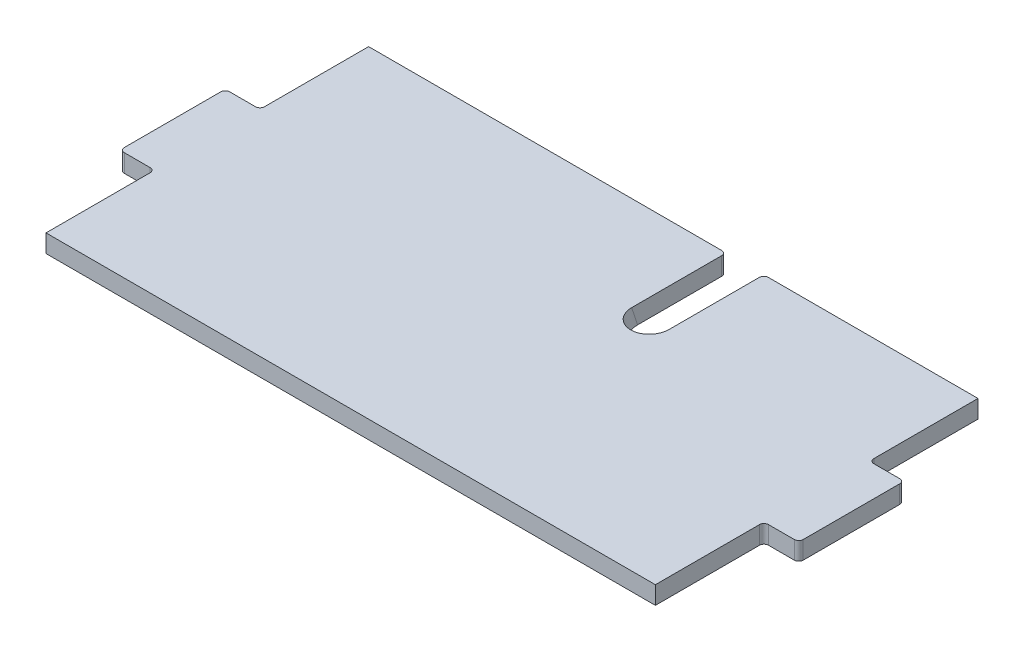
ISO-10303-21;
HEADER;
FILE_DESCRIPTION(('STEP AP214'),'2;1');
FILE_NAME('part.step','',(''),(''),'','','');
FILE_SCHEMA(('AUTOMOTIVE_DESIGN { 1 0 10303 214 1 1 1 1 }'));
ENDSEC;
DATA;
#1=APPLICATION_CONTEXT('core data for automotive mechanical design processes');
#2=APPLICATION_PROTOCOL_DEFINITION('international standard','automotive_design',2000,#1);
#3=PRODUCT_CONTEXT('',#1,'mechanical');
#4=PRODUCT('Part','Part','',(#3));
#5=PRODUCT_RELATED_PRODUCT_CATEGORY('part','',(#4));
#6=PRODUCT_DEFINITION_FORMATION('','',#4);
#7=PRODUCT_DEFINITION_CONTEXT('part definition',#1,'design');
#8=PRODUCT_DEFINITION('design','',#6,#7);
#9=PRODUCT_DEFINITION_SHAPE('','',#8);
#10=(LENGTH_UNIT() NAMED_UNIT(*) SI_UNIT(.MILLI.,.METRE.));
#11=(NAMED_UNIT(*) PLANE_ANGLE_UNIT() SI_UNIT($,.RADIAN.));
#12=(NAMED_UNIT(*) SI_UNIT($,.STERADIAN.) SOLID_ANGLE_UNIT());
#13=UNCERTAINTY_MEASURE_WITH_UNIT(LENGTH_MEASURE(1.E-05),#10,'distance_accuracy_value','');
#14=(GEOMETRIC_REPRESENTATION_CONTEXT(3) GLOBAL_UNCERTAINTY_ASSIGNED_CONTEXT((#13)) GLOBAL_UNIT_ASSIGNED_CONTEXT((#10,
#11,#12)) REPRESENTATION_CONTEXT('',''));
#15=CARTESIAN_POINT('',(0.,0.,0.));
#16=DIRECTION('',(0.,0.,1.));
#17=DIRECTION('',(1.,0.,0.));
#18=AXIS2_PLACEMENT_3D('',#15,#16,#17);
#19=CARTESIAN_POINT('',(-215.9,6.35,-88.9));
#20=DIRECTION('',(0.,0.,1.));
#21=DIRECTION('',(1.,0.,0.));
#22=AXIS2_PLACEMENT_3D('',#19,#20,#21);
#23=PLANE('',#22);
#24=DIRECTION('',(-1.,0.,0.));
#25=VECTOR('',#24,1.);
#26=CARTESIAN_POINT('',(-215.9,6.35,-88.9));
#27=LINE('',#26,#25);
#28=CARTESIAN_POINT('',(34.2899999999983,6.35,-88.9));
#29=VERTEX_POINT('',#28);
#30=CARTESIAN_POINT('',(-215.9,6.35,-88.9));
#31=VERTEX_POINT('',#30);
#32=EDGE_CURVE('E261',#29,#31,#27,.T.);
#33=ORIENTED_EDGE('',*,*,#32,.F.);
#34=DIRECTION('',(0.,1.,0.));
#35=VECTOR('',#34,1.);
#36=CARTESIAN_POINT('',(34.2899999999983,6.35,-88.9));
#37=LINE('',#36,#35);
#38=CARTESIAN_POINT('',(34.2899999999983,-6.35,-88.9));
#39=VERTEX_POINT('',#38);
#40=EDGE_CURVE('E226',#29,#39,#37,.F.);
#41=ORIENTED_EDGE('',*,*,#40,.T.);
#42=DIRECTION('',(-1.,0.,0.));
#43=VECTOR('',#42,1.);
#44=CARTESIAN_POINT('',(-215.9,-6.35,-88.9));
#45=LINE('',#44,#43);
#46=CARTESIAN_POINT('',(-215.9,-6.35,-88.9));
#47=VERTEX_POINT('',#46);
#48=EDGE_CURVE('E220',#39,#47,#45,.T.);
#49=ORIENTED_EDGE('',*,*,#48,.T.);
#50=DIRECTION('',(0.,-1.,0.));
#51=VECTOR('',#50,1.);
#52=CARTESIAN_POINT('',(-215.9,6.35,-88.9));
#53=LINE('',#52,#51);
#54=EDGE_CURVE('E223',#31,#47,#53,.T.);
#55=ORIENTED_EDGE('',*,*,#54,.F.);
#56=EDGE_LOOP('',(#33,#41,#49,#55));
#57=FACE_BOUND('',#56,.T.);
#58=ADVANCED_FACE('F44',(#57),#23,.F.);
#59=CARTESIAN_POINT('',(-215.9,6.35,-88.9));
#60=DIRECTION('',(1.,0.,0.));
#61=DIRECTION('',(0.,0.,-1.));
#62=AXIS2_PLACEMENT_3D('',#59,#60,#61);
#63=PLANE('',#62);
#64=DIRECTION('',(0.,0.,1.));
#65=VECTOR('',#64,1.);
#66=CARTESIAN_POINT('',(-215.9,-6.35,-88.9));
#67=LINE('',#66,#65);
#68=CARTESIAN_POINT('',(-215.9,-6.35,-15.113));
#69=VERTEX_POINT('',#68);
#70=EDGE_CURVE('E237',#47,#69,#67,.T.);
#71=ORIENTED_EDGE('',*,*,#70,.T.);
#72=DIRECTION('',(0.,-1.,0.));
#73=VECTOR('',#72,1.);
#74=CARTESIAN_POINT('',(-215.9,6.35,-15.113));
#75=LINE('',#74,#73);
#76=CARTESIAN_POINT('',(-215.9,6.35,-15.113));
#77=VERTEX_POINT('',#76);
#78=EDGE_CURVE('E439',#69,#77,#75,.F.);
#79=ORIENTED_EDGE('',*,*,#78,.T.);
#80=DIRECTION('',(0.,0.,1.));
#81=VECTOR('',#80,1.);
#82=CARTESIAN_POINT('',(-215.9,6.35,-88.9));
#83=LINE('',#82,#81);
#84=EDGE_CURVE('E240',#31,#77,#83,.T.);
#85=ORIENTED_EDGE('',*,*,#84,.F.);
#86=ORIENTED_EDGE('',*,*,#54,.T.);
#87=EDGE_LOOP('',(#71,#79,#85,#86));
#88=FACE_BOUND('',#87,.T.);
#89=ADVANCED_FACE('F236',(#88),#63,.F.);
#90=CARTESIAN_POINT('',(-241.3,6.35,-11.938));
#91=DIRECTION('',(0.,0.,1.));
#92=DIRECTION('',(1.,0.,0.));
#93=AXIS2_PLACEMENT_3D('',#90,#91,#92);
#94=PLANE('',#93);
#95=DIRECTION('',(-1.,0.,0.));
#96=VECTOR('',#95,1.);
#97=CARTESIAN_POINT('',(-241.3,-6.35,-11.938));
#98=LINE('',#97,#96);
#99=CARTESIAN_POINT('',(-219.075,-6.35,-11.938));
#100=VERTEX_POINT('',#99);
#101=CARTESIAN_POINT('',(-237.363,-6.35,-11.938));
#102=VERTEX_POINT('',#101);
#103=EDGE_CURVE('E242',#100,#102,#98,.T.);
#104=ORIENTED_EDGE('',*,*,#103,.T.);
#105=DIRECTION('',(0.,-1.,0.));
#106=VECTOR('',#105,1.);
#107=CARTESIAN_POINT('',(-237.363,6.35,-11.938));
#108=LINE('',#107,#106);
#109=CARTESIAN_POINT('',(-237.363,6.35,-11.938));
#110=VERTEX_POINT('',#109);
#111=EDGE_CURVE('E436',#102,#110,#108,.F.);
#112=ORIENTED_EDGE('',*,*,#111,.T.);
#113=DIRECTION('',(-1.,0.,0.));
#114=VECTOR('',#113,1.);
#115=CARTESIAN_POINT('',(-241.3,6.35,-11.938));
#116=LINE('',#115,#114);
#117=CARTESIAN_POINT('',(-219.075,6.35,-11.938));
#118=VERTEX_POINT('',#117);
#119=EDGE_CURVE('E280',#118,#110,#116,.T.);
#120=ORIENTED_EDGE('',*,*,#119,.F.);
#121=DIRECTION('',(0.,-1.,0.));
#122=VECTOR('',#121,1.);
#123=CARTESIAN_POINT('',(-219.075,-6.35,-11.938));
#124=LINE('',#123,#122);
#125=EDGE_CURVE('E432',#118,#100,#124,.T.);
#126=ORIENTED_EDGE('',*,*,#125,.T.);
#127=EDGE_LOOP('',(#104,#112,#120,#126));
#128=FACE_BOUND('',#127,.T.);
#129=ADVANCED_FACE('F577',(#128),#94,.F.);
#130=CARTESIAN_POINT('',(-240.538,6.35,-12.7));
#131=DIRECTION('',(1.,0.,0.));
#132=DIRECTION('',(0.,0.,-1.));
#133=AXIS2_PLACEMENT_3D('',#130,#131,#132);
#134=PLANE('',#133);
#135=DIRECTION('',(0.,0.,1.));
#136=VECTOR('',#135,1.);
#137=CARTESIAN_POINT('',(-240.538,-6.35,-12.7));
#138=LINE('',#137,#136);
#139=CARTESIAN_POINT('',(-240.538,-6.35,-8.76299999999999));
#140=VERTEX_POINT('',#139);
#141=CARTESIAN_POINT('',(-240.538,-6.35,59.563));
#142=VERTEX_POINT('',#141);
#143=EDGE_CURVE('E309',#140,#142,#138,.T.);
#144=ORIENTED_EDGE('',*,*,#143,.T.);
#145=DIRECTION('',(0.,-1.,0.));
#146=VECTOR('',#145,1.);
#147=CARTESIAN_POINT('',(-240.538,6.35,59.563));
#148=LINE('',#147,#146);
#149=CARTESIAN_POINT('',(-240.538,6.35,59.563));
#150=VERTEX_POINT('',#149);
#151=EDGE_CURVE('E429',#142,#150,#148,.F.);
#152=ORIENTED_EDGE('',*,*,#151,.T.);
#153=DIRECTION('',(0.,0.,1.));
#154=VECTOR('',#153,1.);
#155=CARTESIAN_POINT('',(-240.538,6.35,-12.7));
#156=LINE('',#155,#154);
#157=CARTESIAN_POINT('',(-240.538,6.35,-8.76299999999999));
#158=VERTEX_POINT('',#157);
#159=EDGE_CURVE('E319',#158,#150,#156,.T.);
#160=ORIENTED_EDGE('',*,*,#159,.F.);
#161=DIRECTION('',(0.,-1.,0.));
#162=VECTOR('',#161,1.);
#163=CARTESIAN_POINT('',(-240.538,6.35,-8.76299999999999));
#164=LINE('',#163,#162);
#165=EDGE_CURVE('E425',#158,#140,#164,.T.);
#166=ORIENTED_EDGE('',*,*,#165,.T.);
#167=EDGE_LOOP('',(#144,#152,#160,#166));
#168=FACE_BOUND('',#167,.T.);
#169=ADVANCED_FACE('F601',(#168),#134,.F.);
#170=CARTESIAN_POINT('',(-215.9,6.35,62.738));
#171=DIRECTION('',(0.,0.,-1.));
#172=DIRECTION('',(-1.,0.,0.));
#173=AXIS2_PLACEMENT_3D('',#170,#171,#172);
#174=PLANE('',#173);
#175=DIRECTION('',(1.,0.,0.));
#176=VECTOR('',#175,1.);
#177=CARTESIAN_POINT('',(-215.9,-6.35,62.738));
#178=LINE('',#177,#176);
#179=CARTESIAN_POINT('',(-237.363,-6.35,62.738));
#180=VERTEX_POINT('',#179);
#181=CARTESIAN_POINT('',(-219.075,-6.35,62.738));
#182=VERTEX_POINT('',#181);
#183=EDGE_CURVE('E305',#180,#182,#178,.T.);
#184=ORIENTED_EDGE('',*,*,#183,.T.);
#185=DIRECTION('',(0.,-1.,0.));
#186=VECTOR('',#185,1.);
#187=CARTESIAN_POINT('',(-219.075,6.35,62.738));
#188=LINE('',#187,#186);
#189=CARTESIAN_POINT('',(-219.075,6.35,62.738));
#190=VERTEX_POINT('',#189);
#191=EDGE_CURVE('E422',#182,#190,#188,.F.);
#192=ORIENTED_EDGE('',*,*,#191,.T.);
#193=DIRECTION('',(1.,0.,0.));
#194=VECTOR('',#193,1.);
#195=CARTESIAN_POINT('',(-215.9,6.35,62.738));
#196=LINE('',#195,#194);
#197=CARTESIAN_POINT('',(-237.363,6.35,62.738));
#198=VERTEX_POINT('',#197);
#199=EDGE_CURVE('E277',#198,#190,#196,.T.);
#200=ORIENTED_EDGE('',*,*,#199,.F.);
#201=DIRECTION('',(0.,-1.,0.));
#202=VECTOR('',#201,1.);
#203=CARTESIAN_POINT('',(-237.363,6.35,62.738));
#204=LINE('',#203,#202);
#205=EDGE_CURVE('E418',#198,#180,#204,.T.);
#206=ORIENTED_EDGE('',*,*,#205,.T.);
#207=EDGE_LOOP('',(#184,#192,#200,#206));
#208=FACE_BOUND('',#207,.T.);
#209=ADVANCED_FACE('F597',(#208),#174,.F.);
#210=CARTESIAN_POINT('',(-215.9,6.35,63.5));
#211=DIRECTION('',(1.,0.,0.));
#212=DIRECTION('',(0.,0.,-1.));
#213=AXIS2_PLACEMENT_3D('',#210,#211,#212);
#214=PLANE('',#213);
#215=DIRECTION('',(0.,0.,1.));
#216=VECTOR('',#215,1.);
#217=CARTESIAN_POINT('',(-215.9,6.35,63.5));
#218=LINE('',#217,#216);
#219=CARTESIAN_POINT('',(-215.9,6.35,65.913));
#220=VERTEX_POINT('',#219);
#221=CARTESIAN_POINT('',(-215.9,6.35,139.7));
#222=VERTEX_POINT('',#221);
#223=EDGE_CURVE('E274',#220,#222,#218,.T.);
#224=ORIENTED_EDGE('',*,*,#223,.F.);
#225=DIRECTION('',(0.,-1.,0.));
#226=VECTOR('',#225,1.);
#227=CARTESIAN_POINT('',(-215.9,-6.35,65.913));
#228=LINE('',#227,#226);
#229=CARTESIAN_POINT('',(-215.9,-6.35,65.913));
#230=VERTEX_POINT('',#229);
#231=EDGE_CURVE('E414',#220,#230,#228,.T.);
#232=ORIENTED_EDGE('',*,*,#231,.T.);
#233=DIRECTION('',(0.,0.,1.));
#234=VECTOR('',#233,1.);
#235=CARTESIAN_POINT('',(-215.9,-6.35,63.5));
#236=LINE('',#235,#234);
#237=CARTESIAN_POINT('',(-215.9,-6.35,139.7));
#238=VERTEX_POINT('',#237);
#239=EDGE_CURVE('E255',#230,#238,#236,.T.);
#240=ORIENTED_EDGE('',*,*,#239,.T.);
#241=DIRECTION('',(0.,-1.,0.));
#242=VECTOR('',#241,1.);
#243=CARTESIAN_POINT('',(-215.9,6.35,139.7));
#244=LINE('',#243,#242);
#245=EDGE_CURVE('E486',#222,#238,#244,.T.);
#246=ORIENTED_EDGE('',*,*,#245,.F.);
#247=EDGE_LOOP('',(#224,#232,#240,#246));
#248=FACE_BOUND('',#247,.T.);
#249=ADVANCED_FACE('F497',(#248),#214,.F.);
#250=CARTESIAN_POINT('',(-215.9,6.35,139.7));
#251=DIRECTION('',(0.,0.,-1.));
#252=DIRECTION('',(-1.,0.,0.));
#253=AXIS2_PLACEMENT_3D('',#250,#251,#252);
#254=PLANE('',#253);
#255=DIRECTION('',(1.,0.,0.));
#256=VECTOR('',#255,1.);
#257=CARTESIAN_POINT('',(-215.9,-6.35,139.7));
#258=LINE('',#257,#256);
#259=CARTESIAN_POINT('',(215.9,-6.35,139.7));
#260=VERTEX_POINT('',#259);
#261=EDGE_CURVE('E490',#238,#260,#258,.T.);
#262=ORIENTED_EDGE('',*,*,#261,.T.);
#263=DIRECTION('',(0.,-1.,0.));
#264=VECTOR('',#263,1.);
#265=CARTESIAN_POINT('',(215.9,6.35,139.7));
#266=LINE('',#265,#264);
#267=CARTESIAN_POINT('',(215.9,6.35,139.7));
#268=VERTEX_POINT('',#267);
#269=EDGE_CURVE('E287',#268,#260,#266,.T.);
#270=ORIENTED_EDGE('',*,*,#269,.F.);
#271=DIRECTION('',(1.,0.,0.));
#272=VECTOR('',#271,1.);
#273=CARTESIAN_POINT('',(-215.9,6.35,139.7));
#274=LINE('',#273,#272);
#275=EDGE_CURVE('E271',#222,#268,#274,.T.);
#276=ORIENTED_EDGE('',*,*,#275,.F.);
#277=ORIENTED_EDGE('',*,*,#245,.T.);
#278=EDGE_LOOP('',(#262,#270,#276,#277));
#279=FACE_BOUND('',#278,.T.);
#280=ADVANCED_FACE('F502',(#279),#254,.F.);
#281=CARTESIAN_POINT('',(215.9,6.35,63.5));
#282=DIRECTION('',(-1.,0.,0.));
#283=DIRECTION('',(0.,0.,1.));
#284=AXIS2_PLACEMENT_3D('',#281,#282,#283);
#285=PLANE('',#284);
#286=DIRECTION('',(0.,0.,-1.));
#287=VECTOR('',#286,1.);
#288=CARTESIAN_POINT('',(215.9,-6.35,63.5));
#289=LINE('',#288,#287);
#290=CARTESIAN_POINT('',(215.9,-6.35,65.913));
#291=VERTEX_POINT('',#290);
#292=EDGE_CURVE('E482',#260,#291,#289,.T.);
#293=ORIENTED_EDGE('',*,*,#292,.T.);
#294=DIRECTION('',(0.,-1.,0.));
#295=VECTOR('',#294,1.);
#296=CARTESIAN_POINT('',(215.9,6.35,65.913));
#297=LINE('',#296,#295);
#298=CARTESIAN_POINT('',(215.9,6.35,65.913));
#299=VERTEX_POINT('',#298);
#300=EDGE_CURVE('E411',#291,#299,#297,.F.);
#301=ORIENTED_EDGE('',*,*,#300,.T.);
#302=DIRECTION('',(0.,0.,-1.));
#303=VECTOR('',#302,1.);
#304=CARTESIAN_POINT('',(215.9,6.35,63.5));
#305=LINE('',#304,#303);
#306=EDGE_CURVE('E266',#268,#299,#305,.T.);
#307=ORIENTED_EDGE('',*,*,#306,.F.);
#308=ORIENTED_EDGE('',*,*,#269,.T.);
#309=EDGE_LOOP('',(#293,#301,#307,#308));
#310=FACE_BOUND('',#309,.T.);
#311=ADVANCED_FACE('F508',(#310),#285,.F.);
#312=CARTESIAN_POINT('',(215.9,6.35,62.738));
#313=DIRECTION('',(0.,0.,-1.));
#314=DIRECTION('',(-1.,0.,0.));
#315=AXIS2_PLACEMENT_3D('',#312,#313,#314);
#316=PLANE('',#315);
#317=DIRECTION('',(1.,0.,0.));
#318=VECTOR('',#317,1.);
#319=CARTESIAN_POINT('',(215.9,-6.35,62.738));
#320=LINE('',#319,#318);
#321=CARTESIAN_POINT('',(219.075,-6.35,62.738));
#322=VERTEX_POINT('',#321);
#323=CARTESIAN_POINT('',(237.363,-6.35,62.738));
#324=VERTEX_POINT('',#323);
#325=EDGE_CURVE('E282',#322,#324,#320,.T.);
#326=ORIENTED_EDGE('',*,*,#325,.T.);
#327=DIRECTION('',(0.,-1.,0.));
#328=VECTOR('',#327,1.);
#329=CARTESIAN_POINT('',(237.363,6.35,62.738));
#330=LINE('',#329,#328);
#331=CARTESIAN_POINT('',(237.363,6.35,62.738));
#332=VERTEX_POINT('',#331);
#333=EDGE_CURVE('E408',#324,#332,#330,.F.);
#334=ORIENTED_EDGE('',*,*,#333,.T.);
#335=DIRECTION('',(1.,0.,0.));
#336=VECTOR('',#335,1.);
#337=CARTESIAN_POINT('',(215.9,6.35,62.738));
#338=LINE('',#337,#336);
#339=CARTESIAN_POINT('',(219.075,6.35,62.738));
#340=VERTEX_POINT('',#339);
#341=EDGE_CURVE('E270',#340,#332,#338,.T.);
#342=ORIENTED_EDGE('',*,*,#341,.F.);
#343=DIRECTION('',(0.,-1.,0.));
#344=VECTOR('',#343,1.);
#345=CARTESIAN_POINT('',(219.075,-6.35,62.738));
#346=LINE('',#345,#344);
#347=EDGE_CURVE('E404',#340,#322,#346,.T.);
#348=ORIENTED_EDGE('',*,*,#347,.T.);
#349=EDGE_LOOP('',(#326,#334,#342,#348));
#350=FACE_BOUND('',#349,.T.);
#351=ADVANCED_FACE('F518',(#350),#316,.F.);
#352=CARTESIAN_POINT('',(240.538,6.35,-12.7));
#353=DIRECTION('',(-1.,0.,0.));
#354=DIRECTION('',(0.,0.,1.));
#355=AXIS2_PLACEMENT_3D('',#352,#353,#354);
#356=PLANE('',#355);
#357=DIRECTION('',(0.,0.,-1.));
#358=VECTOR('',#357,1.);
#359=CARTESIAN_POINT('',(240.538,-6.35,-12.7));
#360=LINE('',#359,#358);
#361=CARTESIAN_POINT('',(240.538,-6.35,59.563));
#362=VERTEX_POINT('',#361);
#363=CARTESIAN_POINT('',(240.538,-6.35,-8.76299999999999));
#364=VERTEX_POINT('',#363);
#365=EDGE_CURVE('E286',#362,#364,#360,.T.);
#366=ORIENTED_EDGE('',*,*,#365,.T.);
#367=DIRECTION('',(0.,-1.,0.));
#368=VECTOR('',#367,1.);
#369=CARTESIAN_POINT('',(240.538,6.35,-8.76299999999999));
#370=LINE('',#369,#368);
#371=CARTESIAN_POINT('',(240.538,6.35,-8.76299999999999));
#372=VERTEX_POINT('',#371);
#373=EDGE_CURVE('E384',#364,#372,#370,.F.);
#374=ORIENTED_EDGE('',*,*,#373,.T.);
#375=DIRECTION('',(0.,0.,-1.));
#376=VECTOR('',#375,1.);
#377=CARTESIAN_POINT('',(240.538,6.35,-12.7));
#378=LINE('',#377,#376);
#379=CARTESIAN_POINT('',(240.538,6.35,59.563));
#380=VERTEX_POINT('',#379);
#381=EDGE_CURVE('E291',#380,#372,#378,.T.);
#382=ORIENTED_EDGE('',*,*,#381,.F.);
#383=DIRECTION('',(0.,-1.,0.));
#384=VECTOR('',#383,1.);
#385=CARTESIAN_POINT('',(240.538,6.35,59.563));
#386=LINE('',#385,#384);
#387=EDGE_CURVE('E380',#380,#362,#386,.T.);
#388=ORIENTED_EDGE('',*,*,#387,.T.);
#389=EDGE_LOOP('',(#366,#374,#382,#388));
#390=FACE_BOUND('',#389,.T.);
#391=ADVANCED_FACE('F526',(#390),#356,.F.);
#392=CARTESIAN_POINT('',(241.3,6.35,-11.938));
#393=DIRECTION('',(0.,0.,1.));
#394=DIRECTION('',(1.,0.,0.));
#395=AXIS2_PLACEMENT_3D('',#392,#393,#394);
#396=PLANE('',#395);
#397=DIRECTION('',(-1.,0.,0.));
#398=VECTOR('',#397,1.);
#399=CARTESIAN_POINT('',(241.3,-6.35,-11.938));
#400=LINE('',#399,#398);
#401=CARTESIAN_POINT('',(237.363,-6.35,-11.938));
#402=VERTEX_POINT('',#401);
#403=CARTESIAN_POINT('',(219.075,-6.35,-11.938));
#404=VERTEX_POINT('',#403);
#405=EDGE_CURVE('E298',#402,#404,#400,.T.);
#406=ORIENTED_EDGE('',*,*,#405,.T.);
#407=DIRECTION('',(0.,-1.,0.));
#408=VECTOR('',#407,1.);
#409=CARTESIAN_POINT('',(219.075,6.35,-11.938));
#410=LINE('',#409,#408);
#411=CARTESIAN_POINT('',(219.075,6.35,-11.938));
#412=VERTEX_POINT('',#411);
#413=EDGE_CURVE('E359',#404,#412,#410,.F.);
#414=ORIENTED_EDGE('',*,*,#413,.T.);
#415=DIRECTION('',(-1.,0.,0.));
#416=VECTOR('',#415,1.);
#417=CARTESIAN_POINT('',(241.3,6.35,-11.938));
#418=LINE('',#417,#416);
#419=CARTESIAN_POINT('',(237.363,6.35,-11.938));
#420=VERTEX_POINT('',#419);
#421=EDGE_CURVE('E265',#420,#412,#418,.T.);
#422=ORIENTED_EDGE('',*,*,#421,.F.);
#423=DIRECTION('',(0.,-1.,0.));
#424=VECTOR('',#423,1.);
#425=CARTESIAN_POINT('',(237.363,6.35,-11.938));
#426=LINE('',#425,#424);
#427=EDGE_CURVE('E355',#420,#402,#426,.T.);
#428=ORIENTED_EDGE('',*,*,#427,.T.);
#429=EDGE_LOOP('',(#406,#414,#422,#428));
#430=FACE_BOUND('',#429,.T.);
#431=ADVANCED_FACE('F535',(#430),#396,.F.);
#432=CARTESIAN_POINT('',(215.9,6.35,-88.9));
#433=DIRECTION('',(-1.,0.,0.));
#434=DIRECTION('',(0.,0.,1.));
#435=AXIS2_PLACEMENT_3D('',#432,#433,#434);
#436=PLANE('',#435);
#437=DIRECTION('',(0.,0.,-1.));
#438=VECTOR('',#437,1.);
#439=CARTESIAN_POINT('',(215.9,6.35,-88.9));
#440=LINE('',#439,#438);
#441=CARTESIAN_POINT('',(215.9,6.35,-15.113));
#442=VERTEX_POINT('',#441);
#443=CARTESIAN_POINT('',(215.9,6.35,-88.9));
#444=VERTEX_POINT('',#443);
#445=EDGE_CURVE('E262',#442,#444,#440,.T.);
#446=ORIENTED_EDGE('',*,*,#445,.F.);
#447=DIRECTION('',(0.,-1.,0.));
#448=VECTOR('',#447,1.);
#449=CARTESIAN_POINT('',(215.9,-6.35,-15.113));
#450=LINE('',#449,#448);
#451=CARTESIAN_POINT('',(215.9,-6.35,-15.113));
#452=VERTEX_POINT('',#451);
#453=EDGE_CURVE('E348',#442,#452,#450,.T.);
#454=ORIENTED_EDGE('',*,*,#453,.T.);
#455=DIRECTION('',(0.,0.,-1.));
#456=VECTOR('',#455,1.);
#457=CARTESIAN_POINT('',(215.9,-6.35,-88.9));
#458=LINE('',#457,#456);
#459=CARTESIAN_POINT('',(215.9,-6.35,-88.9));
#460=VERTEX_POINT('',#459);
#461=EDGE_CURVE('E232',#452,#460,#458,.T.);
#462=ORIENTED_EDGE('',*,*,#461,.T.);
#463=DIRECTION('',(0.,-1.,0.));
#464=VECTOR('',#463,1.);
#465=CARTESIAN_POINT('',(215.9,6.35,-88.9));
#466=LINE('',#465,#464);
#467=EDGE_CURVE('E336',#444,#460,#466,.T.);
#468=ORIENTED_EDGE('',*,*,#467,.F.);
#469=EDGE_LOOP('',(#446,#454,#462,#468));
#470=FACE_BOUND('',#469,.T.);
#471=ADVANCED_FACE('F543',(#470),#436,.F.);
#472=CARTESIAN_POINT('',(67.3099999999985,-6.35,-88.9));
#473=VERTEX_POINT('',#472);
#474=EDGE_CURVE('E231',#460,#473,#45,.T.);
#475=ORIENTED_EDGE('',*,*,#474,.T.);
#476=DIRECTION('',(0.,-1.,0.));
#477=VECTOR('',#476,1.);
#478=CARTESIAN_POINT('',(67.3099999999985,6.35,-88.9));
#479=LINE('',#478,#477);
#480=CARTESIAN_POINT('',(67.3099999999985,6.35,-88.9));
#481=VERTEX_POINT('',#480);
#482=EDGE_CURVE('E68',#473,#481,#479,.F.);
#483=ORIENTED_EDGE('',*,*,#482,.T.);
#484=EDGE_CURVE('E257',#444,#481,#27,.T.);
#485=ORIENTED_EDGE('',*,*,#484,.F.);
#486=ORIENTED_EDGE('',*,*,#467,.T.);
#487=EDGE_LOOP('',(#475,#483,#485,#486));
#488=FACE_BOUND('',#487,.T.);
#489=ADVANCED_FACE('F546',(#488),#23,.F.);
#490=CARTESIAN_POINT('',(0.,6.35,0.));
#491=DIRECTION('',(0.,1.,0.));
#492=DIRECTION('',(0.,0.,1.));
#493=AXIS2_PLACEMENT_3D('',#490,#491,#492);
#494=PLANE('',#493);
#495=ORIENTED_EDGE('',*,*,#381,.T.);
#496=CARTESIAN_POINT('',(237.363,6.35,-8.76299999999999));
#497=DIRECTION('',(0.,1.,0.));
#498=DIRECTION('',(0.,0.,1.));
#499=AXIS2_PLACEMENT_3D('',#496,#497,#498);
#500=CIRCLE('',#499,3.175);
#501=EDGE_CURVE('E401',#372,#420,#500,.T.);
#502=ORIENTED_EDGE('',*,*,#501,.T.);
#503=ORIENTED_EDGE('',*,*,#421,.T.);
#504=CARTESIAN_POINT('',(219.075,6.35,-15.113));
#505=DIRECTION('',(0.,1.,0.));
#506=DIRECTION('',(0.,0.,1.));
#507=AXIS2_PLACEMENT_3D('',#504,#505,#506);
#508=CIRCLE('',#507,3.175);
#509=EDGE_CURVE('E457',#412,#442,#508,.F.);
#510=ORIENTED_EDGE('',*,*,#509,.T.);
#511=ORIENTED_EDGE('',*,*,#445,.T.);
#512=ORIENTED_EDGE('',*,*,#484,.T.);
#513=CARTESIAN_POINT('',(67.3099999999985,6.35,-85.725));
#514=DIRECTION('',(0.,1.,0.));
#515=DIRECTION('',(0.,0.,1.));
#516=AXIS2_PLACEMENT_3D('',#513,#514,#515);
#517=CIRCLE('',#516,3.175);
#518=CARTESIAN_POINT('',(64.1349999999985,6.35,-85.725));
#519=VERTEX_POINT('',#518);
#520=EDGE_CURVE('E60',#481,#519,#517,.T.);
#521=ORIENTED_EDGE('',*,*,#520,.T.);
#522=DIRECTION('',(0.,0.,-1.));
#523=VECTOR('',#522,1.);
#524=CARTESIAN_POINT('',(64.1349999999985,6.35,0.));
#525=LINE('',#524,#523);
#526=CARTESIAN_POINT('',(64.1349999999985,6.34999999999997,-21.9362936905283));
#527=VERTEX_POINT('',#526);
#528=EDGE_CURVE('E329',#527,#519,#525,.T.);
#529=ORIENTED_EDGE('',*,*,#528,.F.);
#530=CARTESIAN_POINT('',(50.7999999999984,6.34999999999997,-21.9362936905283));
#531=DIRECTION('',(0.,1.,0.));
#532=DIRECTION('',(0.,0.,-1.));
#533=AXIS2_PLACEMENT_3D('',#530,#531,#532);
#534=ELLIPSE('',#533,14.0350269898215,13.3350000000001);
#535=CARTESIAN_POINT('',(37.4649999999983,6.34999999999997,-21.9362936905283));
#536=VERTEX_POINT('',#535);
#537=EDGE_CURVE('E281',#527,#536,#534,.F.);
#538=ORIENTED_EDGE('',*,*,#537,.T.);
#539=DIRECTION('',(0.,0.,-1.));
#540=VECTOR('',#539,1.);
#541=CARTESIAN_POINT('',(37.4649999999983,6.35,139.701));
#542=LINE('',#541,#540);
#543=CARTESIAN_POINT('',(37.4649999999983,6.35,-85.725));
#544=VERTEX_POINT('',#543);
#545=EDGE_CURVE('E332',#536,#544,#542,.T.);
#546=ORIENTED_EDGE('',*,*,#545,.T.);
#547=CARTESIAN_POINT('',(34.2899999999983,6.35,-85.725));
#548=DIRECTION('',(0.,1.,0.));
#549=DIRECTION('',(0.,0.,1.));
#550=AXIS2_PLACEMENT_3D('',#547,#548,#549);
#551=CIRCLE('',#550,3.175);
#552=EDGE_CURVE('E389',#544,#29,#551,.T.);
#553=ORIENTED_EDGE('',*,*,#552,.T.);
#554=ORIENTED_EDGE('',*,*,#32,.T.);
#555=ORIENTED_EDGE('',*,*,#84,.T.);
#556=CARTESIAN_POINT('',(-219.075,6.35,-15.113));
#557=DIRECTION('',(0.,1.,0.));
#558=DIRECTION('',(0.,0.,1.));
#559=AXIS2_PLACEMENT_3D('',#556,#557,#558);
#560=CIRCLE('',#559,3.175);
#561=EDGE_CURVE('E12',#77,#118,#560,.F.);
#562=ORIENTED_EDGE('',*,*,#561,.T.);
#563=ORIENTED_EDGE('',*,*,#119,.T.);
#564=CARTESIAN_POINT('',(-237.363,6.35,-8.76299999999999));
#565=DIRECTION('',(0.,1.,0.));
#566=DIRECTION('',(0.,0.,1.));
#567=AXIS2_PLACEMENT_3D('',#564,#565,#566);
#568=CIRCLE('',#567,3.175);
#569=EDGE_CURVE('E392',#110,#158,#568,.T.);
#570=ORIENTED_EDGE('',*,*,#569,.T.);
#571=ORIENTED_EDGE('',*,*,#159,.T.);
#572=CARTESIAN_POINT('',(-237.363,6.35,59.563));
#573=DIRECTION('',(0.,1.,0.));
#574=DIRECTION('',(0.,0.,1.));
#575=AXIS2_PLACEMENT_3D('',#572,#573,#574);
#576=CIRCLE('',#575,3.175);
#577=EDGE_CURVE('E395',#150,#198,#576,.T.);
#578=ORIENTED_EDGE('',*,*,#577,.T.);
#579=ORIENTED_EDGE('',*,*,#199,.T.);
#580=CARTESIAN_POINT('',(-219.075,6.35,65.913));
#581=DIRECTION('',(0.,1.,0.));
#582=DIRECTION('',(0.,0.,1.));
#583=AXIS2_PLACEMENT_3D('',#580,#581,#582);
#584=CIRCLE('',#583,3.175);
#585=EDGE_CURVE('E469',#190,#220,#584,.F.);
#586=ORIENTED_EDGE('',*,*,#585,.T.);
#587=ORIENTED_EDGE('',*,*,#223,.T.);
#588=ORIENTED_EDGE('',*,*,#275,.T.);
#589=ORIENTED_EDGE('',*,*,#306,.T.);
#590=CARTESIAN_POINT('',(219.075,6.35,65.913));
#591=DIRECTION('',(0.,1.,0.));
#592=DIRECTION('',(0.,0.,1.));
#593=AXIS2_PLACEMENT_3D('',#590,#591,#592);
#594=CIRCLE('',#593,3.175);
#595=EDGE_CURVE('E463',#299,#340,#594,.F.);
#596=ORIENTED_EDGE('',*,*,#595,.T.);
#597=ORIENTED_EDGE('',*,*,#341,.T.);
#598=CARTESIAN_POINT('',(237.363,6.35,59.563));
#599=DIRECTION('',(0.,1.,0.));
#600=DIRECTION('',(0.,0.,1.));
#601=AXIS2_PLACEMENT_3D('',#598,#599,#600);
#602=CIRCLE('',#601,3.175);
#603=EDGE_CURVE('E398',#332,#380,#602,.T.);
#604=ORIENTED_EDGE('',*,*,#603,.T.);
#605=EDGE_LOOP('',(#495,#502,#503,#510,#511,#512,#521,#529,#538,#546,#553,#554,#555,#562,#563,
#570,#571,#578,#579,#586,#587,#588,#589,#596,#597,#604));
#606=FACE_BOUND('',#605,.T.);
#607=ADVANCED_FACE('F515',(#606),#494,.T.);
#608=CARTESIAN_POINT('',(0.,-6.35,0.));
#609=DIRECTION('',(0.,1.,0.));
#610=DIRECTION('',(0.,0.,1.));
#611=AXIS2_PLACEMENT_3D('',#608,#609,#610);
#612=PLANE('',#611);
#613=ORIENTED_EDGE('',*,*,#405,.F.);
#614=CARTESIAN_POINT('',(237.363,-6.35,-8.76299999999999));
#615=DIRECTION('',(0.,1.,0.));
#616=DIRECTION('',(0.,0.,1.));
#617=AXIS2_PLACEMENT_3D('',#614,#615,#616);
#618=CIRCLE('',#617,3.175);
#619=EDGE_CURVE('E377',#402,#364,#618,.F.);
#620=ORIENTED_EDGE('',*,*,#619,.T.);
#621=ORIENTED_EDGE('',*,*,#365,.F.);
#622=CARTESIAN_POINT('',(237.363,-6.35,59.563));
#623=DIRECTION('',(0.,1.,0.));
#624=DIRECTION('',(0.,0.,1.));
#625=AXIS2_PLACEMENT_3D('',#622,#623,#624);
#626=CIRCLE('',#625,3.175);
#627=EDGE_CURVE('E374',#362,#324,#626,.F.);
#628=ORIENTED_EDGE('',*,*,#627,.T.);
#629=ORIENTED_EDGE('',*,*,#325,.F.);
#630=CARTESIAN_POINT('',(219.075,-6.35,65.913));
#631=DIRECTION('',(0.,1.,0.));
#632=DIRECTION('',(0.,0.,1.));
#633=AXIS2_PLACEMENT_3D('',#630,#631,#632);
#634=CIRCLE('',#633,3.175);
#635=EDGE_CURVE('E460',#322,#291,#634,.T.);
#636=ORIENTED_EDGE('',*,*,#635,.T.);
#637=ORIENTED_EDGE('',*,*,#292,.F.);
#638=ORIENTED_EDGE('',*,*,#261,.F.);
#639=ORIENTED_EDGE('',*,*,#239,.F.);
#640=CARTESIAN_POINT('',(-219.075,-6.35,65.913));
#641=DIRECTION('',(0.,1.,0.));
#642=DIRECTION('',(0.,0.,1.));
#643=AXIS2_PLACEMENT_3D('',#640,#641,#642);
#644=CIRCLE('',#643,3.175);
#645=EDGE_CURVE('E466',#230,#182,#644,.T.);
#646=ORIENTED_EDGE('',*,*,#645,.T.);
#647=ORIENTED_EDGE('',*,*,#183,.F.);
#648=CARTESIAN_POINT('',(-237.363,-6.35,59.563));
#649=DIRECTION('',(0.,1.,0.));
#650=DIRECTION('',(0.,0.,1.));
#651=AXIS2_PLACEMENT_3D('',#648,#649,#650);
#652=CIRCLE('',#651,3.175);
#653=EDGE_CURVE('E371',#180,#142,#652,.F.);
#654=ORIENTED_EDGE('',*,*,#653,.T.);
#655=ORIENTED_EDGE('',*,*,#143,.F.);
#656=CARTESIAN_POINT('',(-237.363,-6.35,-8.76299999999999));
#657=DIRECTION('',(0.,1.,0.));
#658=DIRECTION('',(0.,0.,1.));
#659=AXIS2_PLACEMENT_3D('',#656,#657,#658);
#660=CIRCLE('',#659,3.175);
#661=EDGE_CURVE('E368',#140,#102,#660,.F.);
#662=ORIENTED_EDGE('',*,*,#661,.T.);
#663=ORIENTED_EDGE('',*,*,#103,.F.);
#664=CARTESIAN_POINT('',(-219.075,-6.35,-15.113));
#665=DIRECTION('',(0.,1.,0.));
#666=DIRECTION('',(0.,0.,1.));
#667=AXIS2_PLACEMENT_3D('',#664,#665,#666);
#668=CIRCLE('',#667,3.175);
#669=EDGE_CURVE('E53',#100,#69,#668,.T.);
#670=ORIENTED_EDGE('',*,*,#669,.T.);
#671=ORIENTED_EDGE('',*,*,#70,.F.);
#672=ORIENTED_EDGE('',*,*,#48,.F.);
#673=CARTESIAN_POINT('',(34.2899999999983,-6.35,-85.725));
#674=DIRECTION('',(0.,1.,0.));
#675=DIRECTION('',(0.,0.,1.));
#676=AXIS2_PLACEMENT_3D('',#673,#674,#675);
#677=CIRCLE('',#676,3.175);
#678=CARTESIAN_POINT('',(37.4649999999983,-6.35,-85.725));
#679=VERTEX_POINT('',#678);
#680=EDGE_CURVE('E365',#39,#679,#677,.F.);
#681=ORIENTED_EDGE('',*,*,#680,.T.);
#682=DIRECTION('',(0.,0.,-1.));
#683=VECTOR('',#682,1.);
#684=CARTESIAN_POINT('',(37.4649999999983,-6.35,139.701));
#685=LINE('',#684,#683);
#686=CARTESIAN_POINT('',(37.4649999999983,-6.34999999999997,-26.1050422974676));
#687=VERTEX_POINT('',#686);
#688=EDGE_CURVE('E340',#687,#679,#685,.T.);
#689=ORIENTED_EDGE('',*,*,#688,.F.);
#690=CARTESIAN_POINT('',(50.7999999999984,-6.34999999999997,-26.1050422974676));
#691=DIRECTION('',(0.,1.,0.));
#692=DIRECTION('',(0.,0.,-1.));
#693=AXIS2_PLACEMENT_3D('',#690,#691,#692);
#694=ELLIPSE('',#693,14.0350269898215,13.3350000000001);
#695=CARTESIAN_POINT('',(64.1349999999985,-6.34999999999996,-26.1050422974676));
#696=VERTEX_POINT('',#695);
#697=EDGE_CURVE('E260',#696,#687,#694,.F.);
#698=ORIENTED_EDGE('',*,*,#697,.F.);
#699=DIRECTION('',(0.,0.,-1.));
#700=VECTOR('',#699,1.);
#701=CARTESIAN_POINT('',(64.1349999999985,-6.35,0.));
#702=LINE('',#701,#700);
#703=CARTESIAN_POINT('',(64.1349999999985,-6.35,-85.725));
#704=VERTEX_POINT('',#703);
#705=EDGE_CURVE('E344',#696,#704,#702,.T.);
#706=ORIENTED_EDGE('',*,*,#705,.T.);
#707=CARTESIAN_POINT('',(67.3099999999985,-6.35,-85.725));
#708=DIRECTION('',(0.,1.,0.));
#709=DIRECTION('',(0.,0.,1.));
#710=AXIS2_PLACEMENT_3D('',#707,#708,#709);
#711=CIRCLE('',#710,3.175);
#712=EDGE_CURVE('E362',#704,#473,#711,.F.);
#713=ORIENTED_EDGE('',*,*,#712,.T.);
#714=ORIENTED_EDGE('',*,*,#474,.F.);
#715=ORIENTED_EDGE('',*,*,#461,.F.);
#716=CARTESIAN_POINT('',(219.075,-6.35,-15.113));
#717=DIRECTION('',(0.,1.,0.));
#718=DIRECTION('',(0.,0.,1.));
#719=AXIS2_PLACEMENT_3D('',#716,#717,#718);
#720=CIRCLE('',#719,3.175);
#721=EDGE_CURVE('E454',#452,#404,#720,.T.);
#722=ORIENTED_EDGE('',*,*,#721,.T.);
#723=EDGE_LOOP('',(#613,#620,#621,#628,#629,#636,#637,#638,#639,#646,#647,#654,#655,#662,#663,
#670,#671,#672,#681,#689,#698,#706,#713,#714,#715,#722));
#724=FACE_BOUND('',#723,.T.);
#725=ADVANCED_FACE('F245',(#724),#612,.F.);
#726=CARTESIAN_POINT('',(50.7999999999984,588.695351800179,169.21735781141));
#727=DIRECTION('',(0.,-0.950122861158083,-0.311875854635749));
#728=DIRECTION('',(0.,0.311875854635749,-0.950122861158082));
#729=AXIS2_PLACEMENT_3D('',#726,#727,#728);
#730=CYLINDRICAL_SURFACE('',#729,13.3350000000001);
#731=DIRECTION('',(0.,-0.950122861158083,-0.311875854635749));
#732=VECTOR('',#731,1.);
#733=CARTESIAN_POINT('',(37.4649999999983,588.695351800179,169.21735781141));
#734=LINE('',#733,#732);
#735=EDGE_CURVE('E251',#687,#536,#734,.F.);
#736=ORIENTED_EDGE('',*,*,#735,.T.);
#737=ORIENTED_EDGE('',*,*,#537,.F.);
#738=DIRECTION('',(0.,-0.950122861158083,-0.311875854635749));
#739=VECTOR('',#738,1.);
#740=CARTESIAN_POINT('',(64.1349999999985,588.695351800179,169.21735781141));
#741=LINE('',#740,#739);
#742=EDGE_CURVE('E248',#696,#527,#741,.F.);
#743=ORIENTED_EDGE('',*,*,#742,.F.);
#744=ORIENTED_EDGE('',*,*,#697,.T.);
#745=EDGE_LOOP('',(#736,#737,#743,#744));
#746=FACE_BOUND('',#745,.T.);
#747=ADVANCED_FACE('F555',(#746),#730,.F.);
#748=CARTESIAN_POINT('',(64.1349999999985,6.34999999999997,139.701));
#749=DIRECTION('',(1.,0.,0.));
#750=DIRECTION('',(0.,0.,-1.));
#751=AXIS2_PLACEMENT_3D('',#748,#749,#750);
#752=PLANE('',#751);
#753=ORIENTED_EDGE('',*,*,#528,.T.);
#754=DIRECTION('',(0.,-1.,0.));
#755=VECTOR('',#754,1.);
#756=CARTESIAN_POINT('',(64.1349999999985,6.34999999999997,-85.725));
#757=LINE('',#756,#755);
#758=EDGE_CURVE('E448',#519,#704,#757,.T.);
#759=ORIENTED_EDGE('',*,*,#758,.T.);
#760=ORIENTED_EDGE('',*,*,#705,.F.);
#761=ORIENTED_EDGE('',*,*,#742,.T.);
#762=EDGE_LOOP('',(#753,#759,#760,#761));
#763=FACE_BOUND('',#762,.T.);
#764=ADVANCED_FACE('F550',(#763),#752,.F.);
#765=CARTESIAN_POINT('',(37.4649999999983,6.35,139.701));
#766=DIRECTION('',(-1.,0.,0.));
#767=DIRECTION('',(0.,0.,1.));
#768=AXIS2_PLACEMENT_3D('',#765,#766,#767);
#769=PLANE('',#768);
#770=ORIENTED_EDGE('',*,*,#688,.T.);
#771=DIRECTION('',(0.,1.,0.));
#772=VECTOR('',#771,1.);
#773=CARTESIAN_POINT('',(37.4649999999983,6.35,-85.725));
#774=LINE('',#773,#772);
#775=EDGE_CURVE('E442',#679,#544,#774,.T.);
#776=ORIENTED_EDGE('',*,*,#775,.T.);
#777=ORIENTED_EDGE('',*,*,#545,.F.);
#778=ORIENTED_EDGE('',*,*,#735,.F.);
#779=EDGE_LOOP('',(#770,#776,#777,#778));
#780=FACE_BOUND('',#779,.T.);
#781=ADVANCED_FACE('F558',(#780),#769,.F.);
#782=CARTESIAN_POINT('',(219.075,6.35,-15.113));
#783=DIRECTION('',(0.,1.,0.));
#784=DIRECTION('',(0.,0.,1.));
#785=AXIS2_PLACEMENT_3D('',#782,#783,#784);
#786=CYLINDRICAL_SURFACE('',#785,3.175);
#787=ORIENTED_EDGE('',*,*,#509,.F.);
#788=ORIENTED_EDGE('',*,*,#413,.F.);
#789=ORIENTED_EDGE('',*,*,#721,.F.);
#790=ORIENTED_EDGE('',*,*,#453,.F.);
#791=EDGE_LOOP('',(#787,#788,#789,#790));
#792=FACE_BOUND('',#791,.T.);
#793=ADVANCED_FACE('F538',(#792),#786,.F.);
#794=CARTESIAN_POINT('',(237.363,6.35,-8.76299999999999));
#795=DIRECTION('',(0.,-1.,0.));
#796=DIRECTION('',(0.,0.,-1.));
#797=AXIS2_PLACEMENT_3D('',#794,#795,#796);
#798=CYLINDRICAL_SURFACE('',#797,3.175);
#799=ORIENTED_EDGE('',*,*,#501,.F.);
#800=ORIENTED_EDGE('',*,*,#373,.F.);
#801=ORIENTED_EDGE('',*,*,#619,.F.);
#802=ORIENTED_EDGE('',*,*,#427,.F.);
#803=EDGE_LOOP('',(#799,#800,#801,#802));
#804=FACE_BOUND('',#803,.T.);
#805=ADVANCED_FACE('F530',(#804),#798,.T.);
#806=CARTESIAN_POINT('',(237.363,6.35,59.563));
#807=DIRECTION('',(0.,-1.,0.));
#808=DIRECTION('',(0.,0.,-1.));
#809=AXIS2_PLACEMENT_3D('',#806,#807,#808);
#810=CYLINDRICAL_SURFACE('',#809,3.175);
#811=ORIENTED_EDGE('',*,*,#603,.F.);
#812=ORIENTED_EDGE('',*,*,#333,.F.);
#813=ORIENTED_EDGE('',*,*,#627,.F.);
#814=ORIENTED_EDGE('',*,*,#387,.F.);
#815=EDGE_LOOP('',(#811,#812,#813,#814));
#816=FACE_BOUND('',#815,.T.);
#817=ADVANCED_FACE('F521',(#816),#810,.T.);
#818=CARTESIAN_POINT('',(219.075,6.35,65.913));
#819=DIRECTION('',(0.,1.,0.));
#820=DIRECTION('',(0.,0.,1.));
#821=AXIS2_PLACEMENT_3D('',#818,#819,#820);
#822=CYLINDRICAL_SURFACE('',#821,3.175);
#823=ORIENTED_EDGE('',*,*,#595,.F.);
#824=ORIENTED_EDGE('',*,*,#300,.F.);
#825=ORIENTED_EDGE('',*,*,#635,.F.);
#826=ORIENTED_EDGE('',*,*,#347,.F.);
#827=EDGE_LOOP('',(#823,#824,#825,#826));
#828=FACE_BOUND('',#827,.T.);
#829=ADVANCED_FACE('F512',(#828),#822,.F.);
#830=CARTESIAN_POINT('',(-219.075,6.35,65.913));
#831=DIRECTION('',(0.,1.,0.));
#832=DIRECTION('',(0.,0.,1.));
#833=AXIS2_PLACEMENT_3D('',#830,#831,#832);
#834=CYLINDRICAL_SURFACE('',#833,3.175);
#835=ORIENTED_EDGE('',*,*,#585,.F.);
#836=ORIENTED_EDGE('',*,*,#191,.F.);
#837=ORIENTED_EDGE('',*,*,#645,.F.);
#838=ORIENTED_EDGE('',*,*,#231,.F.);
#839=EDGE_LOOP('',(#835,#836,#837,#838));
#840=FACE_BOUND('',#839,.T.);
#841=ADVANCED_FACE('F628',(#840),#834,.F.);
#842=CARTESIAN_POINT('',(-237.363,6.35,59.563));
#843=DIRECTION('',(0.,-1.,0.));
#844=DIRECTION('',(0.,0.,-1.));
#845=AXIS2_PLACEMENT_3D('',#842,#843,#844);
#846=CYLINDRICAL_SURFACE('',#845,3.175);
#847=ORIENTED_EDGE('',*,*,#577,.F.);
#848=ORIENTED_EDGE('',*,*,#151,.F.);
#849=ORIENTED_EDGE('',*,*,#653,.F.);
#850=ORIENTED_EDGE('',*,*,#205,.F.);
#851=EDGE_LOOP('',(#847,#848,#849,#850));
#852=FACE_BOUND('',#851,.T.);
#853=ADVANCED_FACE('F631',(#852),#846,.T.);
#854=CARTESIAN_POINT('',(-237.363,6.35,-8.76299999999999));
#855=DIRECTION('',(0.,-1.,0.));
#856=DIRECTION('',(0.,0.,-1.));
#857=AXIS2_PLACEMENT_3D('',#854,#855,#856);
#858=CYLINDRICAL_SURFACE('',#857,3.175);
#859=ORIENTED_EDGE('',*,*,#569,.F.);
#860=ORIENTED_EDGE('',*,*,#111,.F.);
#861=ORIENTED_EDGE('',*,*,#661,.F.);
#862=ORIENTED_EDGE('',*,*,#165,.F.);
#863=EDGE_LOOP('',(#859,#860,#861,#862));
#864=FACE_BOUND('',#863,.T.);
#865=ADVANCED_FACE('F568',(#864),#858,.T.);
#866=CARTESIAN_POINT('',(-219.075,6.35,-15.113));
#867=DIRECTION('',(0.,1.,0.));
#868=DIRECTION('',(0.,0.,1.));
#869=AXIS2_PLACEMENT_3D('',#866,#867,#868);
#870=CYLINDRICAL_SURFACE('',#869,3.175);
#871=ORIENTED_EDGE('',*,*,#561,.F.);
#872=ORIENTED_EDGE('',*,*,#78,.F.);
#873=ORIENTED_EDGE('',*,*,#669,.F.);
#874=ORIENTED_EDGE('',*,*,#125,.F.);
#875=EDGE_LOOP('',(#871,#872,#873,#874));
#876=FACE_BOUND('',#875,.T.);
#877=ADVANCED_FACE('F563',(#876),#870,.F.);
#878=CARTESIAN_POINT('',(34.2899999999983,6.35,-85.725));
#879=DIRECTION('',(0.,1.,0.));
#880=DIRECTION('',(0.,0.,1.));
#881=AXIS2_PLACEMENT_3D('',#878,#879,#880);
#882=CYLINDRICAL_SURFACE('',#881,3.175);
#883=ORIENTED_EDGE('',*,*,#680,.F.);
#884=ORIENTED_EDGE('',*,*,#40,.F.);
#885=ORIENTED_EDGE('',*,*,#552,.F.);
#886=ORIENTED_EDGE('',*,*,#775,.F.);
#887=EDGE_LOOP('',(#883,#884,#885,#886));
#888=FACE_BOUND('',#887,.T.);
#889=ADVANCED_FACE('F561',(#888),#882,.T.);
#890=CARTESIAN_POINT('',(67.3099999999985,6.34999999999997,-85.725));
#891=DIRECTION('',(0.,-1.,0.));
#892=DIRECTION('',(0.,0.,-1.));
#893=AXIS2_PLACEMENT_3D('',#890,#891,#892);
#894=CYLINDRICAL_SURFACE('',#893,3.175);
#895=ORIENTED_EDGE('',*,*,#520,.F.);
#896=ORIENTED_EDGE('',*,*,#482,.F.);
#897=ORIENTED_EDGE('',*,*,#712,.F.);
#898=ORIENTED_EDGE('',*,*,#758,.F.);
#899=EDGE_LOOP('',(#895,#896,#897,#898));
#900=FACE_BOUND('',#899,.T.);
#901=ADVANCED_FACE('F46',(#900),#894,.T.);
#902=CLOSED_SHELL('',(#58,#89,#129,#169,#209,#249,#280,#311,#351,#391,#431,#471,#489,#607,#725,
#747,#764,#781,#793,#805,#817,#829,#841,#853,#865,#877,#889,#901));
#903=MANIFOLD_SOLID_BREP('B2',#902);
#904=ADVANCED_BREP_SHAPE_REPRESENTATION('',(#18,#903),#14);
#905=SHAPE_DEFINITION_REPRESENTATION(#9,#904);
ENDSEC;
END-ISO-10303-21;
